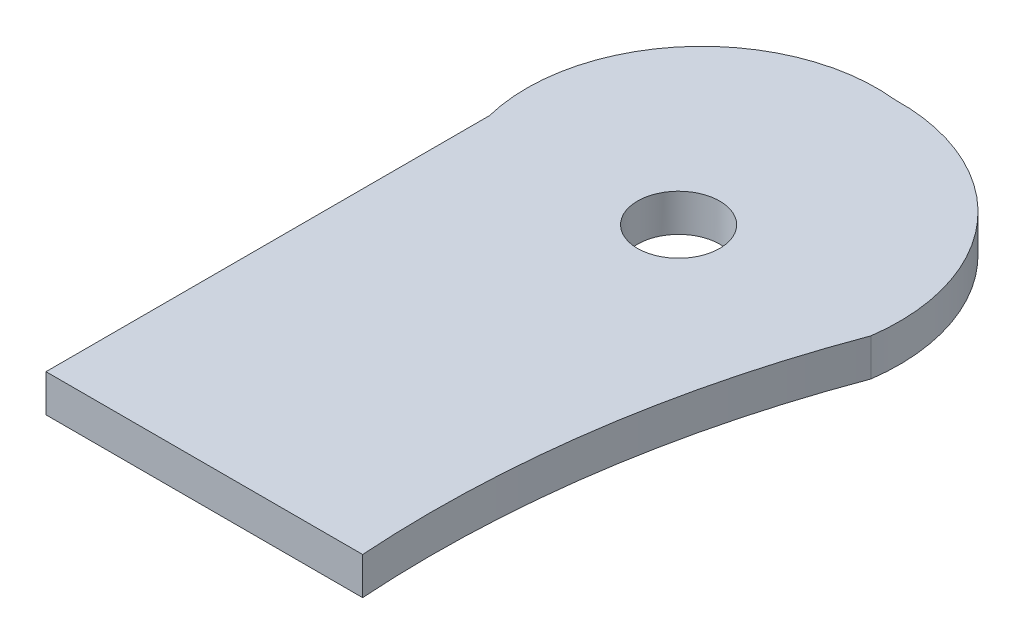
ISO-10303-21;
HEADER;
FILE_DESCRIPTION(('STEP AP214'),'2;1');
FILE_NAME('part.step','',(''),(''),'','','');
FILE_SCHEMA(('AUTOMOTIVE_DESIGN { 1 0 10303 214 1 1 1 1 }'));
ENDSEC;
DATA;
#1=APPLICATION_CONTEXT('core data for automotive mechanical design processes');
#2=APPLICATION_PROTOCOL_DEFINITION('international standard','automotive_design',2000,#1);
#3=PRODUCT_CONTEXT('',#1,'mechanical');
#4=PRODUCT('Part','Part','',(#3));
#5=PRODUCT_RELATED_PRODUCT_CATEGORY('part','',(#4));
#6=PRODUCT_DEFINITION_FORMATION('','',#4);
#7=PRODUCT_DEFINITION_CONTEXT('part definition',#1,'design');
#8=PRODUCT_DEFINITION('design','',#6,#7);
#9=PRODUCT_DEFINITION_SHAPE('','',#8);
#10=(LENGTH_UNIT() NAMED_UNIT(*) SI_UNIT(.MILLI.,.METRE.));
#11=(NAMED_UNIT(*) PLANE_ANGLE_UNIT() SI_UNIT($,.RADIAN.));
#12=(NAMED_UNIT(*) SI_UNIT($,.STERADIAN.) SOLID_ANGLE_UNIT());
#13=UNCERTAINTY_MEASURE_WITH_UNIT(LENGTH_MEASURE(1.E-05),#10,'distance_accuracy_value','');
#14=(GEOMETRIC_REPRESENTATION_CONTEXT(3) GLOBAL_UNCERTAINTY_ASSIGNED_CONTEXT((#13)) GLOBAL_UNIT_ASSIGNED_CONTEXT((#10,
#11,#12)) REPRESENTATION_CONTEXT('',''));
#15=CARTESIAN_POINT('',(0.,0.,0.));
#16=DIRECTION('',(0.,0.,1.));
#17=DIRECTION('',(1.,0.,0.));
#18=AXIS2_PLACEMENT_3D('',#15,#16,#17);
#19=CARTESIAN_POINT('',(-5.652401574742,11.1125,-12.5582922126604));
#20=DIRECTION('',(0.,-1.,0.));
#21=DIRECTION('',(0.,0.,-1.));
#22=AXIS2_PLACEMENT_3D('',#19,#20,#21);
#23=PLANE('',#22);
#24=CARTESIAN_POINT('',(0.,11.1125,0.));
#25=DIRECTION('',(0.,1.,0.));
#26=DIRECTION('',(0.,0.,1.));
#27=AXIS2_PLACEMENT_3D('',#24,#25,#26);
#28=CIRCLE('',#27,12.20390625);
#29=CARTESIAN_POINT('',(0.,11.1125,12.20390625));
#30=VERTEX_POINT('',#29);
#31=EDGE_CURVE('E144',#30,#30,#28,.T.);
#32=ORIENTED_EDGE('',*,*,#31,.F.);
#33=EDGE_LOOP('',(#32));
#34=FACE_BOUND('',#33,.T.);
#35=CARTESIAN_POINT('',(-5.652401574742,11.1125,-12.5582922126604));
#36=DIRECTION('',(0.,1.,0.));
#37=DIRECTION('',(0.,0.,-1.));
#38=AXIS2_PLACEMENT_3D('',#35,#36,#37);
#39=CIRCLE('',#38,52.0433207628773);
#40=CARTESIAN_POINT('',(0.,11.1125,-64.29375));
#41=VERTEX_POINT('',#40);
#42=CARTESIAN_POINT('',(-56.1578125,11.1125,0.));
#43=VERTEX_POINT('',#42);
#44=EDGE_CURVE('E115',#41,#43,#39,.T.);
#45=ORIENTED_EDGE('',*,*,#44,.T.);
#46=DIRECTION('',(0.,0.,1.));
#47=VECTOR('',#46,1.);
#48=CARTESIAN_POINT('',(-56.1578125,11.1125,0.));
#49=LINE('',#48,#47);
#50=CARTESIAN_POINT('',(-56.1578125,11.1125,131.7625));
#51=VERTEX_POINT('',#50);
#52=EDGE_CURVE('E83',#43,#51,#49,.T.);
#53=ORIENTED_EDGE('',*,*,#52,.T.);
#54=DIRECTION('',(1.,0.,0.));
#55=VECTOR('',#54,1.);
#56=CARTESIAN_POINT('',(-56.1578125,11.1125,131.7625));
#57=LINE('',#56,#55);
#58=CARTESIAN_POINT('',(37.9015625,11.1125,131.7625));
#59=VERTEX_POINT('',#58);
#60=EDGE_CURVE('E87',#51,#59,#57,.T.);
#61=ORIENTED_EDGE('',*,*,#60,.T.);
#62=CARTESIAN_POINT('',(352.281061900341,11.1125,110.401223227535));
#63=DIRECTION('',(0.,-1.,0.));
#64=DIRECTION('',(0.,0.,-1.));
#65=AXIS2_PLACEMENT_3D('',#62,#63,#64);
#66=CIRCLE('',#65,315.104385543202);
#67=CARTESIAN_POINT('',(57.1499999999999,11.1125,0.));
#68=VERTEX_POINT('',#67);
#69=EDGE_CURVE('E90',#59,#68,#66,.T.);
#70=ORIENTED_EDGE('',*,*,#69,.T.);
#71=CARTESIAN_POINT('',(1.27123443764086,11.1125,-7.87686116679186));
#72=DIRECTION('',(0.,1.,0.));
#73=DIRECTION('',(0.,0.,-1.));
#74=AXIS2_PLACEMENT_3D('',#71,#72,#73);
#75=CIRCLE('',#74,56.4312092960448);
#76=EDGE_CURVE('E49',#68,#41,#75,.T.);
#77=ORIENTED_EDGE('',*,*,#76,.T.);
#78=EDGE_LOOP('',(#45,#53,#61,#70,#77));
#79=FACE_BOUND('',#78,.T.);
#80=ADVANCED_FACE('F32',(#34,#79),#23,.F.);
#81=CARTESIAN_POINT('',(-5.652401574742,0.,-12.5582922126604));
#82=DIRECTION('',(0.,-1.,0.));
#83=DIRECTION('',(0.,0.,-1.));
#84=AXIS2_PLACEMENT_3D('',#81,#82,#83);
#85=PLANE('',#84);
#86=CARTESIAN_POINT('',(0.,0.,0.));
#87=DIRECTION('',(0.,-1.,0.));
#88=DIRECTION('',(0.,0.,-1.));
#89=AXIS2_PLACEMENT_3D('',#86,#87,#88);
#90=CIRCLE('',#89,12.20390625);
#91=CARTESIAN_POINT('',(0.,0.,-12.20390625));
#92=VERTEX_POINT('',#91);
#93=EDGE_CURVE('E110',#92,#92,#90,.F.);
#94=ORIENTED_EDGE('',*,*,#93,.T.);
#95=EDGE_LOOP('',(#94));
#96=FACE_BOUND('',#95,.T.);
#97=CARTESIAN_POINT('',(-5.652401574742,0.,-12.5582922126604));
#98=DIRECTION('',(0.,1.,0.));
#99=DIRECTION('',(0.,0.,-1.));
#100=AXIS2_PLACEMENT_3D('',#97,#98,#99);
#101=CIRCLE('',#100,52.0433207628773);
#102=CARTESIAN_POINT('',(0.,0.,-64.29375));
#103=VERTEX_POINT('',#102);
#104=CARTESIAN_POINT('',(-56.1578125,0.,0.));
#105=VERTEX_POINT('',#104);
#106=EDGE_CURVE('E106',#103,#105,#101,.T.);
#107=ORIENTED_EDGE('',*,*,#106,.F.);
#108=CARTESIAN_POINT('',(1.27123443764086,0.,-7.87686116679186));
#109=DIRECTION('',(0.,1.,0.));
#110=DIRECTION('',(0.,0.,-1.));
#111=AXIS2_PLACEMENT_3D('',#108,#109,#110);
#112=CIRCLE('',#111,56.4312092960448);
#113=CARTESIAN_POINT('',(57.1499999999999,0.,0.));
#114=VERTEX_POINT('',#113);
#115=EDGE_CURVE('E75',#114,#103,#112,.T.);
#116=ORIENTED_EDGE('',*,*,#115,.F.);
#117=CARTESIAN_POINT('',(352.281061900341,0.,110.401223227535));
#118=DIRECTION('',(0.,-1.,0.));
#119=DIRECTION('',(0.,0.,-1.));
#120=AXIS2_PLACEMENT_3D('',#117,#118,#119);
#121=CIRCLE('',#120,315.104385543202);
#122=CARTESIAN_POINT('',(37.9015625,0.,131.7625));
#123=VERTEX_POINT('',#122);
#124=EDGE_CURVE('E69',#123,#114,#121,.T.);
#125=ORIENTED_EDGE('',*,*,#124,.F.);
#126=DIRECTION('',(1.,0.,0.));
#127=VECTOR('',#126,1.);
#128=CARTESIAN_POINT('',(-56.1578125,0.,131.7625));
#129=LINE('',#128,#127);
#130=CARTESIAN_POINT('',(-56.1578125,0.,131.7625));
#131=VERTEX_POINT('',#130);
#132=EDGE_CURVE('E97',#131,#123,#129,.T.);
#133=ORIENTED_EDGE('',*,*,#132,.F.);
#134=DIRECTION('',(0.,0.,1.));
#135=VECTOR('',#134,1.);
#136=CARTESIAN_POINT('',(-56.1578125,0.,0.));
#137=LINE('',#136,#135);
#138=EDGE_CURVE('E109',#105,#131,#137,.T.);
#139=ORIENTED_EDGE('',*,*,#138,.F.);
#140=EDGE_LOOP('',(#107,#116,#125,#133,#139));
#141=FACE_BOUND('',#140,.T.);
#142=ADVANCED_FACE('F119',(#96,#141),#85,.T.);
#143=CARTESIAN_POINT('',(-5.652401574742,11.1125,-12.5582922126604));
#144=DIRECTION('',(0.,-1.,0.));
#145=DIRECTION('',(0.,0.,-1.));
#146=AXIS2_PLACEMENT_3D('',#143,#144,#145);
#147=CYLINDRICAL_SURFACE('',#146,52.0433207628773);
#148=ORIENTED_EDGE('',*,*,#106,.T.);
#149=DIRECTION('',(0.,-1.,0.));
#150=VECTOR('',#149,1.);
#151=CARTESIAN_POINT('',(-56.1578125,11.1125,0.));
#152=LINE('',#151,#150);
#153=EDGE_CURVE('E11',#43,#105,#152,.T.);
#154=ORIENTED_EDGE('',*,*,#153,.F.);
#155=ORIENTED_EDGE('',*,*,#44,.F.);
#156=DIRECTION('',(0.,-1.,0.));
#157=VECTOR('',#156,1.);
#158=CARTESIAN_POINT('',(0.,11.1125,-64.29375));
#159=LINE('',#158,#157);
#160=EDGE_CURVE('E102',#41,#103,#159,.T.);
#161=ORIENTED_EDGE('',*,*,#160,.T.);
#162=EDGE_LOOP('',(#148,#154,#155,#161));
#163=FACE_BOUND('',#162,.T.);
#164=ADVANCED_FACE('F34',(#163),#147,.T.);
#165=CARTESIAN_POINT('',(-56.1578125,11.1125,0.));
#166=DIRECTION('',(1.,0.,0.));
#167=DIRECTION('',(0.,0.,-1.));
#168=AXIS2_PLACEMENT_3D('',#165,#166,#167);
#169=PLANE('',#168);
#170=ORIENTED_EDGE('',*,*,#138,.T.);
#171=DIRECTION('',(0.,-1.,0.));
#172=VECTOR('',#171,1.);
#173=CARTESIAN_POINT('',(-56.1578125,11.1125,131.7625));
#174=LINE('',#173,#172);
#175=EDGE_CURVE('E41',#51,#131,#174,.T.);
#176=ORIENTED_EDGE('',*,*,#175,.F.);
#177=ORIENTED_EDGE('',*,*,#52,.F.);
#178=ORIENTED_EDGE('',*,*,#153,.T.);
#179=EDGE_LOOP('',(#170,#176,#177,#178));
#180=FACE_BOUND('',#179,.T.);
#181=ADVANCED_FACE('F154',(#180),#169,.F.);
#182=CARTESIAN_POINT('',(-56.1578125,11.1125,131.7625));
#183=DIRECTION('',(0.,0.,-1.));
#184=DIRECTION('',(-1.,0.,0.));
#185=AXIS2_PLACEMENT_3D('',#182,#183,#184);
#186=PLANE('',#185);
#187=ORIENTED_EDGE('',*,*,#132,.T.);
#188=DIRECTION('',(0.,-1.,0.));
#189=VECTOR('',#188,1.);
#190=CARTESIAN_POINT('',(37.9015625,11.1125,131.7625));
#191=LINE('',#190,#189);
#192=EDGE_CURVE('E94',#59,#123,#191,.T.);
#193=ORIENTED_EDGE('',*,*,#192,.F.);
#194=ORIENTED_EDGE('',*,*,#60,.F.);
#195=ORIENTED_EDGE('',*,*,#175,.T.);
#196=EDGE_LOOP('',(#187,#193,#194,#195));
#197=FACE_BOUND('',#196,.T.);
#198=ADVANCED_FACE('F95',(#197),#186,.F.);
#199=CARTESIAN_POINT('',(352.281061900341,11.1125,110.401223227535));
#200=DIRECTION('',(0.,-1.,0.));
#201=DIRECTION('',(0.,0.,-1.));
#202=AXIS2_PLACEMENT_3D('',#199,#200,#201);
#203=CYLINDRICAL_SURFACE('',#202,315.104385543202);
#204=ORIENTED_EDGE('',*,*,#124,.T.);
#205=DIRECTION('',(0.,-1.,0.));
#206=VECTOR('',#205,1.);
#207=CARTESIAN_POINT('',(57.1499999999999,11.1125,0.));
#208=LINE('',#207,#206);
#209=EDGE_CURVE('E98',#68,#114,#208,.T.);
#210=ORIENTED_EDGE('',*,*,#209,.F.);
#211=ORIENTED_EDGE('',*,*,#69,.F.);
#212=ORIENTED_EDGE('',*,*,#192,.T.);
#213=EDGE_LOOP('',(#204,#210,#211,#212));
#214=FACE_BOUND('',#213,.T.);
#215=ADVANCED_FACE('F100',(#214),#203,.F.);
#216=CARTESIAN_POINT('',(1.27123443764086,11.1125,-7.87686116679186));
#217=DIRECTION('',(0.,-1.,0.));
#218=DIRECTION('',(0.,0.,-1.));
#219=AXIS2_PLACEMENT_3D('',#216,#217,#218);
#220=CYLINDRICAL_SURFACE('',#219,56.4312092960448);
#221=ORIENTED_EDGE('',*,*,#115,.T.);
#222=ORIENTED_EDGE('',*,*,#160,.F.);
#223=ORIENTED_EDGE('',*,*,#76,.F.);
#224=ORIENTED_EDGE('',*,*,#209,.T.);
#225=EDGE_LOOP('',(#221,#222,#223,#224));
#226=FACE_BOUND('',#225,.T.);
#227=ADVANCED_FACE('F123',(#226),#220,.T.);
#228=CARTESIAN_POINT('',(0.,-34.5178594653596,0.));
#229=DIRECTION('',(0.,1.,0.));
#230=DIRECTION('',(0.,0.,1.));
#231=AXIS2_PLACEMENT_3D('',#228,#229,#230);
#232=CYLINDRICAL_SURFACE('',#231,12.20390625);
#233=ORIENTED_EDGE('',*,*,#31,.T.);
#234=EDGE_LOOP('',(#233));
#235=FACE_BOUND('',#234,.T.);
#236=ORIENTED_EDGE('',*,*,#93,.F.);
#237=EDGE_LOOP('',(#236));
#238=FACE_BOUND('',#237,.T.);
#239=ADVANCED_FACE('F125',(#235,#238),#232,.F.);
#240=CLOSED_SHELL('',(#80,#142,#164,#181,#198,#215,#227,#239));
#241=MANIFOLD_SOLID_BREP('B2',#240);
#242=ADVANCED_BREP_SHAPE_REPRESENTATION('',(#18,#241),#14);
#243=SHAPE_DEFINITION_REPRESENTATION(#9,#242);
ENDSEC;
END-ISO-10303-21;
